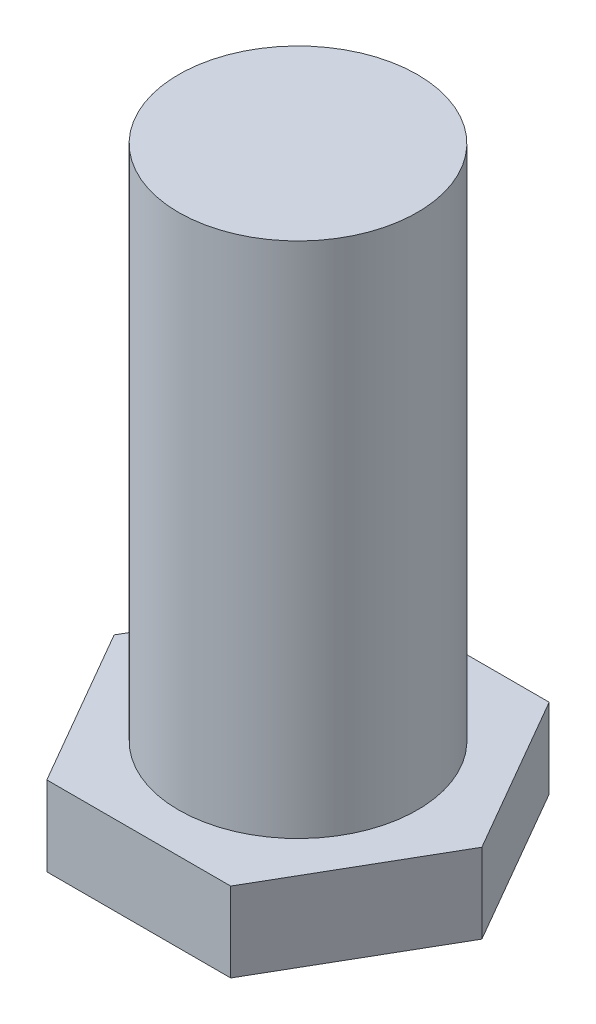
ISO-10303-21;
HEADER;
FILE_DESCRIPTION(('STEP AP214'),'2;1');
FILE_NAME('part.step','',(''),(''),'','','');
FILE_SCHEMA(('AUTOMOTIVE_DESIGN { 1 0 10303 214 1 1 1 1 }'));
ENDSEC;
DATA;
#1=APPLICATION_CONTEXT('core data for automotive mechanical design processes');
#2=APPLICATION_PROTOCOL_DEFINITION('international standard','automotive_design',2000,#1);
#3=PRODUCT_CONTEXT('',#1,'mechanical');
#4=PRODUCT('Part','Part','',(#3));
#5=PRODUCT_RELATED_PRODUCT_CATEGORY('part','',(#4));
#6=PRODUCT_DEFINITION_FORMATION('','',#4);
#7=PRODUCT_DEFINITION_CONTEXT('part definition',#1,'design');
#8=PRODUCT_DEFINITION('design','',#6,#7);
#9=PRODUCT_DEFINITION_SHAPE('','',#8);
#10=(LENGTH_UNIT() NAMED_UNIT(*) SI_UNIT(.MILLI.,.METRE.));
#11=(NAMED_UNIT(*) PLANE_ANGLE_UNIT() SI_UNIT($,.RADIAN.));
#12=(NAMED_UNIT(*) SI_UNIT($,.STERADIAN.) SOLID_ANGLE_UNIT());
#13=UNCERTAINTY_MEASURE_WITH_UNIT(LENGTH_MEASURE(1.E-05),#10,'distance_accuracy_value','');
#14=(GEOMETRIC_REPRESENTATION_CONTEXT(3) GLOBAL_UNCERTAINTY_ASSIGNED_CONTEXT((#13)) GLOBAL_UNIT_ASSIGNED_CONTEXT((#10,
#11,#12)) REPRESENTATION_CONTEXT('',''));
#15=CARTESIAN_POINT('',(0.,0.,0.));
#16=DIRECTION('',(0.,0.,1.));
#17=DIRECTION('',(1.,0.,0.));
#18=AXIS2_PLACEMENT_3D('',#15,#16,#17);
#19=CARTESIAN_POINT('',(2.3094010767585,2.,4.));
#20=DIRECTION('',(-0.866025403784439,0.,-0.5));
#21=DIRECTION('',(-0.5,0.,0.866025403784439));
#22=AXIS2_PLACEMENT_3D('',#19,#20,#21);
#23=PLANE('',#22);
#24=DIRECTION('',(0.5,0.,-0.866025403784439));
#25=VECTOR('',#24,1.);
#26=CARTESIAN_POINT('',(2.3094010767585,0.,4.));
#27=LINE('',#26,#25);
#28=CARTESIAN_POINT('',(2.3094010767585,0.,4.));
#29=VERTEX_POINT('',#28);
#30=CARTESIAN_POINT('',(4.61880215351701,0.,0.));
#31=VERTEX_POINT('',#30);
#32=EDGE_CURVE('E128',#29,#31,#27,.T.);
#33=ORIENTED_EDGE('',*,*,#32,.T.);
#34=DIRECTION('',(0.,-1.,0.));
#35=VECTOR('',#34,1.);
#36=CARTESIAN_POINT('',(4.61880215351701,2.,0.));
#37=LINE('',#36,#35);
#38=CARTESIAN_POINT('',(4.61880215351701,2.,0.));
#39=VERTEX_POINT('',#38);
#40=EDGE_CURVE('E11',#39,#31,#37,.T.);
#41=ORIENTED_EDGE('',*,*,#40,.F.);
#42=DIRECTION('',(0.5,0.,-0.866025403784439));
#43=VECTOR('',#42,1.);
#44=CARTESIAN_POINT('',(2.3094010767585,2.,4.));
#45=LINE('',#44,#43);
#46=CARTESIAN_POINT('',(2.3094010767585,2.,4.));
#47=VERTEX_POINT('',#46);
#48=EDGE_CURVE('E145',#47,#39,#45,.T.);
#49=ORIENTED_EDGE('',*,*,#48,.F.);
#50=DIRECTION('',(0.,-1.,0.));
#51=VECTOR('',#50,1.);
#52=CARTESIAN_POINT('',(2.3094010767585,2.,4.));
#53=LINE('',#52,#51);
#54=EDGE_CURVE('E124',#47,#29,#53,.T.);
#55=ORIENTED_EDGE('',*,*,#54,.T.);
#56=EDGE_LOOP('',(#33,#41,#49,#55));
#57=FACE_BOUND('',#56,.T.);
#58=ADVANCED_FACE('F39',(#57),#23,.F.);
#59=CARTESIAN_POINT('',(4.61880215351701,2.,0.));
#60=DIRECTION('',(-0.866025403784438,0.,0.5));
#61=DIRECTION('',(0.5,0.,0.866025403784439));
#62=AXIS2_PLACEMENT_3D('',#59,#60,#61);
#63=PLANE('',#62);
#64=DIRECTION('',(-0.5,0.,-0.866025403784438));
#65=VECTOR('',#64,1.);
#66=CARTESIAN_POINT('',(4.61880215351701,0.,0.));
#67=LINE('',#66,#65);
#68=CARTESIAN_POINT('',(2.3094010767585,0.,-4.));
#69=VERTEX_POINT('',#68);
#70=EDGE_CURVE('E132',#31,#69,#67,.T.);
#71=ORIENTED_EDGE('',*,*,#70,.T.);
#72=DIRECTION('',(0.,-1.,0.));
#73=VECTOR('',#72,1.);
#74=CARTESIAN_POINT('',(2.3094010767585,2.,-4.));
#75=LINE('',#74,#73);
#76=CARTESIAN_POINT('',(2.3094010767585,2.,-4.));
#77=VERTEX_POINT('',#76);
#78=EDGE_CURVE('E48',#77,#69,#75,.T.);
#79=ORIENTED_EDGE('',*,*,#78,.F.);
#80=DIRECTION('',(-0.5,0.,-0.866025403784438));
#81=VECTOR('',#80,1.);
#82=CARTESIAN_POINT('',(4.61880215351701,2.,0.));
#83=LINE('',#82,#81);
#84=EDGE_CURVE('E93',#39,#77,#83,.T.);
#85=ORIENTED_EDGE('',*,*,#84,.F.);
#86=ORIENTED_EDGE('',*,*,#40,.T.);
#87=EDGE_LOOP('',(#71,#79,#85,#86));
#88=FACE_BOUND('',#87,.T.);
#89=ADVANCED_FACE('F174',(#88),#63,.F.);
#90=CARTESIAN_POINT('',(2.3094010767585,2.,-4.));
#91=DIRECTION('',(0.,0.,1.));
#92=DIRECTION('',(1.,0.,0.));
#93=AXIS2_PLACEMENT_3D('',#90,#91,#92);
#94=PLANE('',#93);
#95=DIRECTION('',(-1.,0.,0.));
#96=VECTOR('',#95,1.);
#97=CARTESIAN_POINT('',(2.3094010767585,0.,-4.));
#98=LINE('',#97,#96);
#99=CARTESIAN_POINT('',(-2.3094010767585,0.,-4.));
#100=VERTEX_POINT('',#99);
#101=EDGE_CURVE('E136',#69,#100,#98,.T.);
#102=ORIENTED_EDGE('',*,*,#101,.T.);
#103=DIRECTION('',(0.,-1.,0.));
#104=VECTOR('',#103,1.);
#105=CARTESIAN_POINT('',(-2.3094010767585,2.,-4.));
#106=LINE('',#105,#104);
#107=CARTESIAN_POINT('',(-2.3094010767585,2.,-4.));
#108=VERTEX_POINT('',#107);
#109=EDGE_CURVE('E117',#108,#100,#106,.T.);
#110=ORIENTED_EDGE('',*,*,#109,.F.);
#111=DIRECTION('',(-1.,0.,0.));
#112=VECTOR('',#111,1.);
#113=CARTESIAN_POINT('',(2.3094010767585,2.,-4.));
#114=LINE('',#113,#112);
#115=EDGE_CURVE('E106',#77,#108,#114,.T.);
#116=ORIENTED_EDGE('',*,*,#115,.F.);
#117=ORIENTED_EDGE('',*,*,#78,.T.);
#118=EDGE_LOOP('',(#102,#110,#116,#117));
#119=FACE_BOUND('',#118,.T.);
#120=ADVANCED_FACE('F155',(#119),#94,.F.);
#121=CARTESIAN_POINT('',(-2.3094010767585,2.,-4.));
#122=DIRECTION('',(0.866025403784439,0.,0.5));
#123=DIRECTION('',(0.5,0.,-0.866025403784439));
#124=AXIS2_PLACEMENT_3D('',#121,#122,#123);
#125=PLANE('',#124);
#126=DIRECTION('',(-0.5,0.,0.866025403784439));
#127=VECTOR('',#126,1.);
#128=CARTESIAN_POINT('',(-2.3094010767585,0.,-4.));
#129=LINE('',#128,#127);
#130=CARTESIAN_POINT('',(-4.61880215351701,0.,0.));
#131=VERTEX_POINT('',#130);
#132=EDGE_CURVE('E115',#100,#131,#129,.T.);
#133=ORIENTED_EDGE('',*,*,#132,.T.);
#134=DIRECTION('',(0.,-1.,0.));
#135=VECTOR('',#134,1.);
#136=CARTESIAN_POINT('',(-4.61880215351701,2.,0.));
#137=LINE('',#136,#135);
#138=CARTESIAN_POINT('',(-4.61880215351701,2.,0.));
#139=VERTEX_POINT('',#138);
#140=EDGE_CURVE('E112',#139,#131,#137,.T.);
#141=ORIENTED_EDGE('',*,*,#140,.F.);
#142=DIRECTION('',(-0.5,0.,0.866025403784439));
#143=VECTOR('',#142,1.);
#144=CARTESIAN_POINT('',(-2.3094010767585,2.,-4.));
#145=LINE('',#144,#143);
#146=EDGE_CURVE('E100',#108,#139,#145,.T.);
#147=ORIENTED_EDGE('',*,*,#146,.F.);
#148=ORIENTED_EDGE('',*,*,#109,.T.);
#149=EDGE_LOOP('',(#133,#141,#147,#148));
#150=FACE_BOUND('',#149,.T.);
#151=ADVANCED_FACE('F113',(#150),#125,.F.);
#152=CARTESIAN_POINT('',(-4.61880215351701,2.,0.));
#153=DIRECTION('',(0.866025403784439,0.,-0.5));
#154=DIRECTION('',(-0.5,0.,-0.866025403784439));
#155=AXIS2_PLACEMENT_3D('',#152,#153,#154);
#156=PLANE('',#155);
#157=DIRECTION('',(0.5,0.,0.866025403784439));
#158=VECTOR('',#157,1.);
#159=CARTESIAN_POINT('',(-4.61880215351701,0.,0.));
#160=LINE('',#159,#158);
#161=CARTESIAN_POINT('',(-2.3094010767585,0.,4.));
#162=VERTEX_POINT('',#161);
#163=EDGE_CURVE('E79',#131,#162,#160,.T.);
#164=ORIENTED_EDGE('',*,*,#163,.T.);
#165=DIRECTION('',(0.,-1.,0.));
#166=VECTOR('',#165,1.);
#167=CARTESIAN_POINT('',(-2.3094010767585,2.,4.));
#168=LINE('',#167,#166);
#169=CARTESIAN_POINT('',(-2.3094010767585,2.,4.));
#170=VERTEX_POINT('',#169);
#171=EDGE_CURVE('E118',#170,#162,#168,.T.);
#172=ORIENTED_EDGE('',*,*,#171,.F.);
#173=DIRECTION('',(0.5,0.,0.866025403784439));
#174=VECTOR('',#173,1.);
#175=CARTESIAN_POINT('',(-4.61880215351701,2.,0.));
#176=LINE('',#175,#174);
#177=EDGE_CURVE('E104',#139,#170,#176,.T.);
#178=ORIENTED_EDGE('',*,*,#177,.F.);
#179=ORIENTED_EDGE('',*,*,#140,.T.);
#180=EDGE_LOOP('',(#164,#172,#178,#179));
#181=FACE_BOUND('',#180,.T.);
#182=ADVANCED_FACE('F120',(#181),#156,.F.);
#183=CARTESIAN_POINT('',(-2.3094010767585,2.,4.));
#184=DIRECTION('',(0.,0.,-1.));
#185=DIRECTION('',(-1.,0.,0.));
#186=AXIS2_PLACEMENT_3D('',#183,#184,#185);
#187=PLANE('',#186);
#188=DIRECTION('',(1.,0.,0.));
#189=VECTOR('',#188,1.);
#190=CARTESIAN_POINT('',(-2.3094010767585,0.,4.));
#191=LINE('',#190,#189);
#192=EDGE_CURVE('E85',#162,#29,#191,.T.);
#193=ORIENTED_EDGE('',*,*,#192,.T.);
#194=ORIENTED_EDGE('',*,*,#54,.F.);
#195=DIRECTION('',(1.,0.,0.));
#196=VECTOR('',#195,1.);
#197=CARTESIAN_POINT('',(-2.3094010767585,2.,4.));
#198=LINE('',#197,#196);
#199=EDGE_CURVE('E56',#170,#47,#198,.T.);
#200=ORIENTED_EDGE('',*,*,#199,.F.);
#201=ORIENTED_EDGE('',*,*,#171,.T.);
#202=EDGE_LOOP('',(#193,#194,#200,#201));
#203=FACE_BOUND('',#202,.T.);
#204=ADVANCED_FACE('F162',(#203),#187,.F.);
#205=CARTESIAN_POINT('',(0.,2.,0.));
#206=DIRECTION('',(0.,1.,0.));
#207=DIRECTION('',(0.,0.,1.));
#208=AXIS2_PLACEMENT_3D('',#205,#206,#207);
#209=PLANE('',#208);
#210=CARTESIAN_POINT('',(0.,2.,0.));
#211=DIRECTION('',(0.,1.,0.));
#212=DIRECTION('',(0.,0.,1.));
#213=AXIS2_PLACEMENT_3D('',#210,#211,#212);
#214=CIRCLE('',#213,3.);
#215=CARTESIAN_POINT('',(0.,2.,3.));
#216=VERTEX_POINT('',#215);
#217=EDGE_CURVE('E133',#216,#216,#214,.F.);
#218=ORIENTED_EDGE('',*,*,#217,.T.);
#219=EDGE_LOOP('',(#218));
#220=FACE_BOUND('',#219,.T.);
#221=ORIENTED_EDGE('',*,*,#48,.T.);
#222=ORIENTED_EDGE('',*,*,#84,.T.);
#223=ORIENTED_EDGE('',*,*,#115,.T.);
#224=ORIENTED_EDGE('',*,*,#146,.T.);
#225=ORIENTED_EDGE('',*,*,#177,.T.);
#226=ORIENTED_EDGE('',*,*,#199,.T.);
#227=EDGE_LOOP('',(#221,#222,#223,#224,#225,#226));
#228=FACE_BOUND('',#227,.T.);
#229=ADVANCED_FACE('F102',(#220,#228),#209,.T.);
#230=CARTESIAN_POINT('',(0.,0.,0.));
#231=DIRECTION('',(0.,1.,0.));
#232=DIRECTION('',(0.,0.,1.));
#233=AXIS2_PLACEMENT_3D('',#230,#231,#232);
#234=PLANE('',#233);
#235=ORIENTED_EDGE('',*,*,#32,.F.);
#236=ORIENTED_EDGE('',*,*,#192,.F.);
#237=ORIENTED_EDGE('',*,*,#163,.F.);
#238=ORIENTED_EDGE('',*,*,#132,.F.);
#239=ORIENTED_EDGE('',*,*,#101,.F.);
#240=ORIENTED_EDGE('',*,*,#70,.F.);
#241=EDGE_LOOP('',(#235,#236,#237,#238,#239,#240));
#242=FACE_BOUND('',#241,.T.);
#243=ADVANCED_FACE('F158',(#242),#234,.F.);
#244=CARTESIAN_POINT('',(0.,15.,0.));
#245=DIRECTION('',(0.,-1.,0.));
#246=DIRECTION('',(0.,0.,-1.));
#247=AXIS2_PLACEMENT_3D('',#244,#245,#246);
#248=CYLINDRICAL_SURFACE('',#247,3.);
#249=ORIENTED_EDGE('',*,*,#217,.F.);
#250=EDGE_LOOP('',(#249));
#251=FACE_BOUND('',#250,.T.);
#252=CARTESIAN_POINT('',(0.,15.,0.));
#253=DIRECTION('',(0.,1.,0.));
#254=DIRECTION('',(0.,0.,1.));
#255=AXIS2_PLACEMENT_3D('',#252,#253,#254);
#256=CIRCLE('',#255,3.);
#257=CARTESIAN_POINT('',(0.,15.,3.));
#258=VERTEX_POINT('',#257);
#259=EDGE_CURVE('E235',#258,#258,#256,.T.);
#260=ORIENTED_EDGE('',*,*,#259,.F.);
#261=EDGE_LOOP('',(#260));
#262=FACE_BOUND('',#261,.T.);
#263=ADVANCED_FACE('F211',(#251,#262),#248,.T.);
#264=CARTESIAN_POINT('',(0.,15.,0.));
#265=DIRECTION('',(0.,1.,0.));
#266=DIRECTION('',(0.,0.,1.));
#267=AXIS2_PLACEMENT_3D('',#264,#265,#266);
#268=PLANE('',#267);
#269=ORIENTED_EDGE('',*,*,#259,.T.);
#270=EDGE_LOOP('',(#269));
#271=FACE_BOUND('',#270,.T.);
#272=ADVANCED_FACE('F219',(#271),#268,.T.);
#273=CLOSED_SHELL('',(#58,#89,#120,#151,#182,#204,#229,#243,#263,#272));
#274=MANIFOLD_SOLID_BREP('B2',#273);
#275=ADVANCED_BREP_SHAPE_REPRESENTATION('',(#18,#274),#14);
#276=SHAPE_DEFINITION_REPRESENTATION(#9,#275);
ENDSEC;
END-ISO-10303-21;
